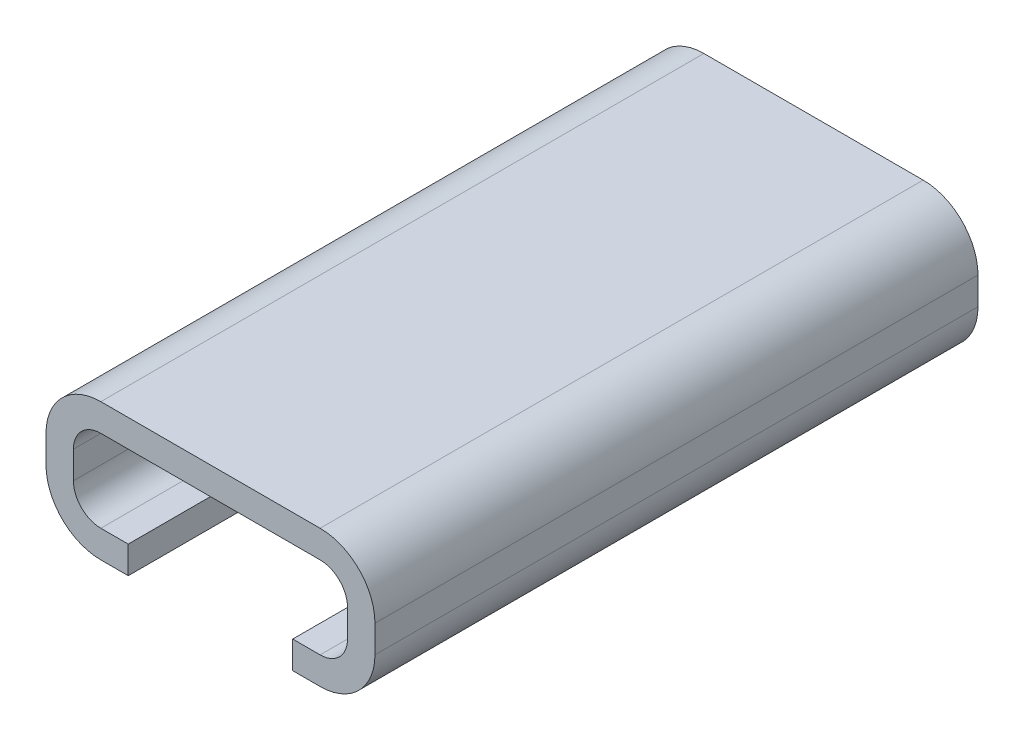
ISO-10303-21;
HEADER;
FILE_DESCRIPTION(('STEP AP214'),'2;1');
FILE_NAME('part.step','',(''),(''),'','','');
FILE_SCHEMA(('AUTOMOTIVE_DESIGN { 1 0 10303 214 1 1 1 1 }'));
ENDSEC;
DATA;
#1=APPLICATION_CONTEXT('core data for automotive mechanical design processes');
#2=APPLICATION_PROTOCOL_DEFINITION('international standard','automotive_design',2000,#1);
#3=PRODUCT_CONTEXT('',#1,'mechanical');
#4=PRODUCT('Part','Part','',(#3));
#5=PRODUCT_RELATED_PRODUCT_CATEGORY('part','',(#4));
#6=PRODUCT_DEFINITION_FORMATION('','',#4);
#7=PRODUCT_DEFINITION_CONTEXT('part definition',#1,'design');
#8=PRODUCT_DEFINITION('design','',#6,#7);
#9=PRODUCT_DEFINITION_SHAPE('','',#8);
#10=(LENGTH_UNIT() NAMED_UNIT(*) SI_UNIT(.MILLI.,.METRE.));
#11=(NAMED_UNIT(*) PLANE_ANGLE_UNIT() SI_UNIT($,.RADIAN.));
#12=(NAMED_UNIT(*) SI_UNIT($,.STERADIAN.) SOLID_ANGLE_UNIT());
#13=UNCERTAINTY_MEASURE_WITH_UNIT(LENGTH_MEASURE(1.E-05),#10,'distance_accuracy_value','');
#14=(GEOMETRIC_REPRESENTATION_CONTEXT(3) GLOBAL_UNCERTAINTY_ASSIGNED_CONTEXT((#13)) GLOBAL_UNIT_ASSIGNED_CONTEXT((#10,
#11,#12)) REPRESENTATION_CONTEXT('',''));
#15=CARTESIAN_POINT('',(0.,0.,0.));
#16=DIRECTION('',(0.,0.,1.));
#17=DIRECTION('',(1.,0.,0.));
#18=AXIS2_PLACEMENT_3D('',#15,#16,#17);
#19=CARTESIAN_POINT('',(4.,-1.5,10.));
#20=DIRECTION('',(0.,-1.,0.));
#21=DIRECTION('',(1.,0.,0.));
#22=AXIS2_PLACEMENT_3D('',#19,#20,#21);
#23=PLANE('',#22);
#24=DIRECTION('',(-1.,0.,0.));
#25=VECTOR('',#24,1.);
#26=CARTESIAN_POINT('',(4.,-1.5,10.));
#27=LINE('',#26,#25);
#28=CARTESIAN_POINT('',(-3.,-1.5,10.));
#29=VERTEX_POINT('',#28);
#30=CARTESIAN_POINT('',(-4.,-1.5,10.));
#31=VERTEX_POINT('',#30);
#32=EDGE_CURVE('E445',#29,#31,#27,.T.);
#33=ORIENTED_EDGE('',*,*,#32,.F.);
#34=DIRECTION('',(0.,0.,1.));
#35=VECTOR('',#34,1.);
#36=CARTESIAN_POINT('',(-3.,-1.5,10.));
#37=LINE('',#36,#35);
#38=CARTESIAN_POINT('',(-3.,-1.5,0.));
#39=VERTEX_POINT('',#38);
#40=EDGE_CURVE('E312',#39,#29,#37,.T.);
#41=ORIENTED_EDGE('',*,*,#40,.F.);
#42=DIRECTION('',(-1.,0.,0.));
#43=VECTOR('',#42,1.);
#44=CARTESIAN_POINT('',(4.,-1.5,0.));
#45=LINE('',#44,#43);
#46=CARTESIAN_POINT('',(-4.,-1.5,0.));
#47=VERTEX_POINT('',#46);
#48=EDGE_CURVE('E469',#39,#47,#45,.T.);
#49=ORIENTED_EDGE('',*,*,#48,.T.);
#50=DIRECTION('',(0.,0.,-1.));
#51=VECTOR('',#50,1.);
#52=CARTESIAN_POINT('',(-4.,-1.5,10.));
#53=LINE('',#52,#51);
#54=EDGE_CURVE('E498',#31,#47,#53,.T.);
#55=ORIENTED_EDGE('',*,*,#54,.F.);
#56=EDGE_LOOP('',(#33,#41,#49,#55));
#57=FACE_BOUND('',#56,.T.);
#58=ADVANCED_FACE('F84',(#57),#23,.F.);
#59=CARTESIAN_POINT('',(4.,-1.5,-12.));
#60=DIRECTION('',(0.,-1.,0.));
#61=DIRECTION('',(1.,0.,0.));
#62=AXIS2_PLACEMENT_3D('',#59,#60,#61);
#63=PLANE('',#62);
#64=DIRECTION('',(-1.,0.,0.));
#65=VECTOR('',#64,1.);
#66=CARTESIAN_POINT('',(4.,-1.5,-12.));
#67=LINE('',#66,#65);
#68=CARTESIAN_POINT('',(4.,-1.5,-12.));
#69=VERTEX_POINT('',#68);
#70=CARTESIAN_POINT('',(3.,-1.5,-12.));
#71=VERTEX_POINT('',#70);
#72=EDGE_CURVE('E355',#69,#71,#67,.T.);
#73=ORIENTED_EDGE('',*,*,#72,.T.);
#74=DIRECTION('',(0.,0.,-1.));
#75=VECTOR('',#74,1.);
#76=CARTESIAN_POINT('',(3.,-1.5,-12.));
#77=LINE('',#76,#75);
#78=CARTESIAN_POINT('',(3.,-1.5,-2.));
#79=VERTEX_POINT('',#78);
#80=EDGE_CURVE('E375',#79,#71,#77,.T.);
#81=ORIENTED_EDGE('',*,*,#80,.F.);
#82=DIRECTION('',(-1.,0.,0.));
#83=VECTOR('',#82,1.);
#84=CARTESIAN_POINT('',(4.,-1.5,-2.));
#85=LINE('',#84,#83);
#86=CARTESIAN_POINT('',(4.,-1.5,-2.));
#87=VERTEX_POINT('',#86);
#88=EDGE_CURVE('E299',#87,#79,#85,.T.);
#89=ORIENTED_EDGE('',*,*,#88,.F.);
#90=DIRECTION('',(0.,0.,1.));
#91=VECTOR('',#90,1.);
#92=CARTESIAN_POINT('',(4.,-1.5,-12.));
#93=LINE('',#92,#91);
#94=EDGE_CURVE('E399',#69,#87,#93,.T.);
#95=ORIENTED_EDGE('',*,*,#94,.F.);
#96=EDGE_LOOP('',(#73,#81,#89,#95));
#97=FACE_BOUND('',#96,.T.);
#98=ADVANCED_FACE('F625',(#97),#63,.F.);
#99=CARTESIAN_POINT('',(4.,0.500000000000002,10.));
#100=DIRECTION('',(0.,0.,-1.));
#101=DIRECTION('',(-1.,0.,0.));
#102=AXIS2_PLACEMENT_3D('',#99,#100,#101);
#103=PLANE('',#102);
#104=DIRECTION('',(-1.,0.,0.));
#105=VECTOR('',#104,1.);
#106=CARTESIAN_POINT('',(4.,-2.5,10.));
#107=LINE('',#106,#105);
#108=CARTESIAN_POINT('',(-3.,-2.5,10.));
#109=VERTEX_POINT('',#108);
#110=CARTESIAN_POINT('',(-4.,-2.5,10.));
#111=VERTEX_POINT('',#110);
#112=EDGE_CURVE('E516',#109,#111,#107,.T.);
#113=ORIENTED_EDGE('',*,*,#112,.F.);
#114=DIRECTION('',(0.,-1.,0.));
#115=VECTOR('',#114,1.);
#116=CARTESIAN_POINT('',(-3.,10.1619037896906,10.));
#117=LINE('',#116,#115);
#118=EDGE_CURVE('E328',#29,#109,#117,.T.);
#119=ORIENTED_EDGE('',*,*,#118,.F.);
#120=ORIENTED_EDGE('',*,*,#32,.T.);
#121=CARTESIAN_POINT('',(-4.,-0.5,10.));
#122=DIRECTION('',(0.,0.,-1.));
#123=DIRECTION('',(-1.,0.,0.));
#124=AXIS2_PLACEMENT_3D('',#121,#122,#123);
#125=CIRCLE('',#124,1.);
#126=CARTESIAN_POINT('',(-5.,-0.5,10.));
#127=VERTEX_POINT('',#126);
#128=EDGE_CURVE('E442',#31,#127,#125,.T.);
#129=ORIENTED_EDGE('',*,*,#128,.T.);
#130=DIRECTION('',(0.,1.,0.));
#131=VECTOR('',#130,1.);
#132=CARTESIAN_POINT('',(-5.,-0.5,10.));
#133=LINE('',#132,#131);
#134=CARTESIAN_POINT('',(-5.,0.5,10.));
#135=VERTEX_POINT('',#134);
#136=EDGE_CURVE('E438',#127,#135,#133,.T.);
#137=ORIENTED_EDGE('',*,*,#136,.T.);
#138=CARTESIAN_POINT('',(-4.,0.5,10.));
#139=DIRECTION('',(0.,0.,1.));
#140=DIRECTION('',(1.,0.,0.));
#141=AXIS2_PLACEMENT_3D('',#138,#139,#140);
#142=CIRCLE('',#141,1.);
#143=CARTESIAN_POINT('',(-4.,1.5,10.));
#144=VERTEX_POINT('',#143);
#145=EDGE_CURVE('E436',#144,#135,#142,.T.);
#146=ORIENTED_EDGE('',*,*,#145,.F.);
#147=DIRECTION('',(1.,0.,0.));
#148=VECTOR('',#147,1.);
#149=CARTESIAN_POINT('',(-4.,1.5,10.));
#150=LINE('',#149,#148);
#151=CARTESIAN_POINT('',(4.,1.5,10.));
#152=VERTEX_POINT('',#151);
#153=EDGE_CURVE('E458',#144,#152,#150,.T.);
#154=ORIENTED_EDGE('',*,*,#153,.T.);
#155=CARTESIAN_POINT('',(4.,0.500000000000002,10.));
#156=DIRECTION('',(0.,0.,-1.));
#157=DIRECTION('',(-1.,0.,0.));
#158=AXIS2_PLACEMENT_3D('',#155,#156,#157);
#159=CIRCLE('',#158,0.999999999999998);
#160=CARTESIAN_POINT('',(5.,0.500000000000002,10.));
#161=VERTEX_POINT('',#160);
#162=EDGE_CURVE('E455',#152,#161,#159,.T.);
#163=ORIENTED_EDGE('',*,*,#162,.T.);
#164=DIRECTION('',(0.,-1.,0.));
#165=VECTOR('',#164,1.);
#166=CARTESIAN_POINT('',(5.,0.500000000000002,10.));
#167=LINE('',#166,#165);
#168=CARTESIAN_POINT('',(5.,-0.5,10.));
#169=VERTEX_POINT('',#168);
#170=EDGE_CURVE('E452',#161,#169,#167,.T.);
#171=ORIENTED_EDGE('',*,*,#170,.T.);
#172=CARTESIAN_POINT('',(4.,-0.5,10.));
#173=DIRECTION('',(0.,0.,-1.));
#174=DIRECTION('',(-1.,0.,0.));
#175=AXIS2_PLACEMENT_3D('',#172,#173,#174);
#176=CIRCLE('',#175,1.);
#177=CARTESIAN_POINT('',(4.,-1.5,10.));
#178=VERTEX_POINT('',#177);
#179=EDGE_CURVE('E449',#169,#178,#176,.T.);
#180=ORIENTED_EDGE('',*,*,#179,.T.);
#181=CARTESIAN_POINT('',(3.,-1.5,10.));
#182=VERTEX_POINT('',#181);
#183=EDGE_CURVE('E446',#178,#182,#27,.T.);
#184=ORIENTED_EDGE('',*,*,#183,.T.);
#185=DIRECTION('',(0.,-1.,0.));
#186=VECTOR('',#185,1.);
#187=CARTESIAN_POINT('',(3.,10.1619037896906,10.));
#188=LINE('',#187,#186);
#189=CARTESIAN_POINT('',(3.,-2.5,10.));
#190=VERTEX_POINT('',#189);
#191=EDGE_CURVE('E339',#182,#190,#188,.T.);
#192=ORIENTED_EDGE('',*,*,#191,.T.);
#193=CARTESIAN_POINT('',(4.,-2.5,10.));
#194=VERTEX_POINT('',#193);
#195=EDGE_CURVE('E517',#194,#190,#107,.T.);
#196=ORIENTED_EDGE('',*,*,#195,.F.);
#197=CARTESIAN_POINT('',(4.,-0.5,10.));
#198=DIRECTION('',(0.,0.,-1.));
#199=DIRECTION('',(-1.,0.,0.));
#200=AXIS2_PLACEMENT_3D('',#197,#198,#199);
#201=CIRCLE('',#200,2.);
#202=CARTESIAN_POINT('',(6.,-0.5,10.));
#203=VERTEX_POINT('',#202);
#204=EDGE_CURVE('E513',#203,#194,#201,.T.);
#205=ORIENTED_EDGE('',*,*,#204,.F.);
#206=DIRECTION('',(0.,-1.,0.));
#207=VECTOR('',#206,1.);
#208=CARTESIAN_POINT('',(6.,0.500000000000002,10.));
#209=LINE('',#208,#207);
#210=CARTESIAN_POINT('',(6.,0.500000000000002,10.));
#211=VERTEX_POINT('',#210);
#212=EDGE_CURVE('E510',#211,#203,#209,.T.);
#213=ORIENTED_EDGE('',*,*,#212,.F.);
#214=CARTESIAN_POINT('',(4.,0.500000000000002,10.));
#215=DIRECTION('',(0.,0.,-1.));
#216=DIRECTION('',(-1.,0.,0.));
#217=AXIS2_PLACEMENT_3D('',#214,#215,#216);
#218=CIRCLE('',#217,2.);
#219=CARTESIAN_POINT('',(4.,2.5,10.));
#220=VERTEX_POINT('',#219);
#221=EDGE_CURVE('E507',#220,#211,#218,.T.);
#222=ORIENTED_EDGE('',*,*,#221,.F.);
#223=DIRECTION('',(1.,0.,0.));
#224=VECTOR('',#223,1.);
#225=CARTESIAN_POINT('',(-4.,2.5,10.));
#226=LINE('',#225,#224);
#227=CARTESIAN_POINT('',(-4.,2.5,10.));
#228=VERTEX_POINT('',#227);
#229=EDGE_CURVE('E528',#228,#220,#226,.T.);
#230=ORIENTED_EDGE('',*,*,#229,.F.);
#231=CARTESIAN_POINT('',(-4.,0.5,10.));
#232=DIRECTION('',(0.,0.,1.));
#233=DIRECTION('',(1.,0.,0.));
#234=AXIS2_PLACEMENT_3D('',#231,#232,#233);
#235=CIRCLE('',#234,2.);
#236=CARTESIAN_POINT('',(-6.,0.500000000000001,10.));
#237=VERTEX_POINT('',#236);
#238=EDGE_CURVE('E526',#228,#237,#235,.T.);
#239=ORIENTED_EDGE('',*,*,#238,.T.);
#240=DIRECTION('',(0.,1.,0.));
#241=VECTOR('',#240,1.);
#242=CARTESIAN_POINT('',(-6.,-0.5,10.));
#243=LINE('',#242,#241);
#244=CARTESIAN_POINT('',(-6.,-0.5,10.));
#245=VERTEX_POINT('',#244);
#246=EDGE_CURVE('E523',#245,#237,#243,.T.);
#247=ORIENTED_EDGE('',*,*,#246,.F.);
#248=CARTESIAN_POINT('',(-4.,-0.5,10.));
#249=DIRECTION('',(0.,0.,-1.));
#250=DIRECTION('',(-1.,0.,0.));
#251=AXIS2_PLACEMENT_3D('',#248,#249,#250);
#252=CIRCLE('',#251,2.);
#253=EDGE_CURVE('E520',#111,#245,#252,.T.);
#254=ORIENTED_EDGE('',*,*,#253,.F.);
#255=EDGE_LOOP('',(#113,#119,#120,#129,#137,#146,#154,#163,#171,#180,#184,#192,#196,#205,#213,
#222,#230,#239,#247,#254));
#256=FACE_BOUND('',#255,.T.);
#257=ADVANCED_FACE('F559',(#256),#103,.F.);
#258=CARTESIAN_POINT('',(4.,0.500000000000002,10.));
#259=DIRECTION('',(0.,0.,-1.));
#260=DIRECTION('',(-1.,0.,0.));
#261=AXIS2_PLACEMENT_3D('',#258,#259,#260);
#262=CYLINDRICAL_SURFACE('',#261,2.);
#263=DIRECTION('',(0.,0.,-1.));
#264=VECTOR('',#263,1.);
#265=CARTESIAN_POINT('',(6.,0.500000000000002,10.));
#266=LINE('',#265,#264);
#267=CARTESIAN_POINT('',(6.,0.500000000000002,-12.));
#268=VERTEX_POINT('',#267);
#269=EDGE_CURVE('E88',#211,#268,#266,.T.);
#270=ORIENTED_EDGE('',*,*,#269,.T.);
#271=CARTESIAN_POINT('',(4.,0.500000000000002,-12.));
#272=DIRECTION('',(0.,0.,-1.));
#273=DIRECTION('',(-1.,0.,0.));
#274=AXIS2_PLACEMENT_3D('',#271,#272,#273);
#275=CIRCLE('',#274,2.);
#276=CARTESIAN_POINT('',(4.,2.5,-12.));
#277=VERTEX_POINT('',#276);
#278=EDGE_CURVE('E411',#277,#268,#275,.T.);
#279=ORIENTED_EDGE('',*,*,#278,.F.);
#280=DIRECTION('',(0.,0.,-1.));
#281=VECTOR('',#280,1.);
#282=CARTESIAN_POINT('',(4.,2.5,10.));
#283=LINE('',#282,#281);
#284=EDGE_CURVE('E12',#220,#277,#283,.T.);
#285=ORIENTED_EDGE('',*,*,#284,.F.);
#286=ORIENTED_EDGE('',*,*,#221,.T.);
#287=EDGE_LOOP('',(#270,#279,#285,#286));
#288=FACE_BOUND('',#287,.T.);
#289=ADVANCED_FACE('F86',(#288),#262,.T.);
#290=CARTESIAN_POINT('',(4.,2.5,10.));
#291=DIRECTION('',(0.,-1.,0.));
#292=DIRECTION('',(1.,0.,0.));
#293=AXIS2_PLACEMENT_3D('',#290,#291,#292);
#294=PLANE('',#293);
#295=ORIENTED_EDGE('',*,*,#284,.T.);
#296=DIRECTION('',(1.,0.,0.));
#297=VECTOR('',#296,1.);
#298=CARTESIAN_POINT('',(-4.,2.5,-12.));
#299=LINE('',#298,#297);
#300=CARTESIAN_POINT('',(-4.,2.5,-12.));
#301=VERTEX_POINT('',#300);
#302=EDGE_CURVE('E432',#301,#277,#299,.T.);
#303=ORIENTED_EDGE('',*,*,#302,.F.);
#304=DIRECTION('',(0.,0.,-1.));
#305=VECTOR('',#304,1.);
#306=CARTESIAN_POINT('',(-4.,2.5,10.));
#307=LINE('',#306,#305);
#308=EDGE_CURVE('E93',#228,#301,#307,.T.);
#309=ORIENTED_EDGE('',*,*,#308,.F.);
#310=ORIENTED_EDGE('',*,*,#229,.T.);
#311=EDGE_LOOP('',(#295,#303,#309,#310));
#312=FACE_BOUND('',#311,.T.);
#313=ADVANCED_FACE('F554',(#312),#294,.F.);
#314=CARTESIAN_POINT('',(-4.,0.5,10.));
#315=DIRECTION('',(0.,0.,-1.));
#316=DIRECTION('',(-1.,0.,0.));
#317=AXIS2_PLACEMENT_3D('',#314,#315,#316);
#318=CYLINDRICAL_SURFACE('',#317,2.);
#319=ORIENTED_EDGE('',*,*,#308,.T.);
#320=CARTESIAN_POINT('',(-4.,0.5,-12.));
#321=DIRECTION('',(0.,0.,1.));
#322=DIRECTION('',(1.,0.,0.));
#323=AXIS2_PLACEMENT_3D('',#320,#321,#322);
#324=CIRCLE('',#323,2.);
#325=CARTESIAN_POINT('',(-6.,0.500000000000001,-12.));
#326=VERTEX_POINT('',#325);
#327=EDGE_CURVE('E429',#301,#326,#324,.T.);
#328=ORIENTED_EDGE('',*,*,#327,.T.);
#329=DIRECTION('',(0.,0.,-1.));
#330=VECTOR('',#329,1.);
#331=CARTESIAN_POINT('',(-6.,0.500000000000001,10.));
#332=LINE('',#331,#330);
#333=EDGE_CURVE('E531',#237,#326,#332,.T.);
#334=ORIENTED_EDGE('',*,*,#333,.F.);
#335=ORIENTED_EDGE('',*,*,#238,.F.);
#336=EDGE_LOOP('',(#319,#328,#334,#335));
#337=FACE_BOUND('',#336,.T.);
#338=ADVANCED_FACE('F684',(#337),#318,.T.);
#339=CARTESIAN_POINT('',(-6.,-0.5,10.));
#340=DIRECTION('',(-1.,0.,0.));
#341=DIRECTION('',(0.,0.,1.));
#342=AXIS2_PLACEMENT_3D('',#339,#340,#341);
#343=PLANE('',#342);
#344=ORIENTED_EDGE('',*,*,#333,.T.);
#345=DIRECTION('',(0.,1.,0.));
#346=VECTOR('',#345,1.);
#347=CARTESIAN_POINT('',(-6.,-0.5,-12.));
#348=LINE('',#347,#346);
#349=CARTESIAN_POINT('',(-6.,-0.5,-12.));
#350=VERTEX_POINT('',#349);
#351=EDGE_CURVE('E426',#350,#326,#348,.T.);
#352=ORIENTED_EDGE('',*,*,#351,.F.);
#353=DIRECTION('',(0.,0.,-1.));
#354=VECTOR('',#353,1.);
#355=CARTESIAN_POINT('',(-6.,-0.5,10.));
#356=LINE('',#355,#354);
#357=EDGE_CURVE('E533',#245,#350,#356,.T.);
#358=ORIENTED_EDGE('',*,*,#357,.F.);
#359=ORIENTED_EDGE('',*,*,#246,.T.);
#360=EDGE_LOOP('',(#344,#352,#358,#359));
#361=FACE_BOUND('',#360,.T.);
#362=ADVANCED_FACE('F687',(#361),#343,.T.);
#363=CARTESIAN_POINT('',(-4.,-0.5,10.));
#364=DIRECTION('',(0.,0.,-1.));
#365=DIRECTION('',(-1.,0.,0.));
#366=AXIS2_PLACEMENT_3D('',#363,#364,#365);
#367=CYLINDRICAL_SURFACE('',#366,2.);
#368=ORIENTED_EDGE('',*,*,#357,.T.);
#369=CARTESIAN_POINT('',(-4.,-0.5,-12.));
#370=DIRECTION('',(0.,0.,-1.));
#371=DIRECTION('',(-1.,0.,0.));
#372=AXIS2_PLACEMENT_3D('',#369,#370,#371);
#373=CIRCLE('',#372,2.);
#374=CARTESIAN_POINT('',(-4.,-2.5,-12.));
#375=VERTEX_POINT('',#374);
#376=EDGE_CURVE('E423',#375,#350,#373,.T.);
#377=ORIENTED_EDGE('',*,*,#376,.F.);
#378=DIRECTION('',(0.,0.,-1.));
#379=VECTOR('',#378,1.);
#380=CARTESIAN_POINT('',(-4.,-2.5,10.));
#381=LINE('',#380,#379);
#382=EDGE_CURVE('E535',#111,#375,#381,.T.);
#383=ORIENTED_EDGE('',*,*,#382,.F.);
#384=ORIENTED_EDGE('',*,*,#253,.T.);
#385=EDGE_LOOP('',(#368,#377,#383,#384));
#386=FACE_BOUND('',#385,.T.);
#387=ADVANCED_FACE('F612',(#386),#367,.T.);
#388=CARTESIAN_POINT('',(4.,-2.5,10.));
#389=DIRECTION('',(0.,-1.,0.));
#390=DIRECTION('',(1.,0.,0.));
#391=AXIS2_PLACEMENT_3D('',#388,#389,#390);
#392=PLANE('',#391);
#393=DIRECTION('',(0.,0.,1.));
#394=VECTOR('',#393,1.);
#395=CARTESIAN_POINT('',(3.,-2.5,-12.));
#396=LINE('',#395,#394);
#397=CARTESIAN_POINT('',(3.,-2.5,-12.));
#398=VERTEX_POINT('',#397);
#399=CARTESIAN_POINT('',(3.,-2.5,-2.));
#400=VERTEX_POINT('',#399);
#401=EDGE_CURVE('E305',#398,#400,#396,.T.);
#402=ORIENTED_EDGE('',*,*,#401,.F.);
#403=DIRECTION('',(-1.,0.,0.));
#404=VECTOR('',#403,1.);
#405=CARTESIAN_POINT('',(4.,-2.5,-12.));
#406=LINE('',#405,#404);
#407=CARTESIAN_POINT('',(4.,-2.5,-12.));
#408=VERTEX_POINT('',#407);
#409=EDGE_CURVE('E421',#408,#398,#406,.T.);
#410=ORIENTED_EDGE('',*,*,#409,.F.);
#411=DIRECTION('',(0.,0.,-1.));
#412=VECTOR('',#411,1.);
#413=CARTESIAN_POINT('',(4.,-2.5,10.));
#414=LINE('',#413,#412);
#415=EDGE_CURVE('E538',#194,#408,#414,.T.);
#416=ORIENTED_EDGE('',*,*,#415,.F.);
#417=ORIENTED_EDGE('',*,*,#195,.T.);
#418=DIRECTION('',(0.,0.,1.));
#419=VECTOR('',#418,1.);
#420=CARTESIAN_POINT('',(3.,-2.5,10.));
#421=LINE('',#420,#419);
#422=CARTESIAN_POINT('',(3.,-2.5,0.));
#423=VERTEX_POINT('',#422);
#424=EDGE_CURVE('E335',#423,#190,#421,.T.);
#425=ORIENTED_EDGE('',*,*,#424,.F.);
#426=DIRECTION('',(1.,0.,0.));
#427=VECTOR('',#426,1.);
#428=CARTESIAN_POINT('',(-3.,-2.5,0.));
#429=LINE('',#428,#427);
#430=CARTESIAN_POINT('',(-3.,-2.5,0.));
#431=VERTEX_POINT('',#430);
#432=EDGE_CURVE('E333',#431,#423,#429,.T.);
#433=ORIENTED_EDGE('',*,*,#432,.F.);
#434=DIRECTION('',(0.,0.,-1.));
#435=VECTOR('',#434,1.);
#436=CARTESIAN_POINT('',(-3.,-2.5,10.));
#437=LINE('',#436,#435);
#438=EDGE_CURVE('E330',#109,#431,#437,.T.);
#439=ORIENTED_EDGE('',*,*,#438,.F.);
#440=ORIENTED_EDGE('',*,*,#112,.T.);
#441=ORIENTED_EDGE('',*,*,#382,.T.);
#442=CARTESIAN_POINT('',(-3.,-2.5,-12.));
#443=VERTEX_POINT('',#442);
#444=EDGE_CURVE('E420',#443,#375,#406,.T.);
#445=ORIENTED_EDGE('',*,*,#444,.F.);
#446=DIRECTION('',(0.,0.,-1.));
#447=VECTOR('',#446,1.);
#448=CARTESIAN_POINT('',(-3.,-2.5,-12.));
#449=LINE('',#448,#447);
#450=CARTESIAN_POINT('',(-3.,-2.5,-2.));
#451=VERTEX_POINT('',#450);
#452=EDGE_CURVE('E302',#451,#443,#449,.T.);
#453=ORIENTED_EDGE('',*,*,#452,.F.);
#454=DIRECTION('',(-1.,0.,0.));
#455=VECTOR('',#454,1.);
#456=CARTESIAN_POINT('',(3.,-2.5,-2.));
#457=LINE('',#456,#455);
#458=EDGE_CURVE('E296',#400,#451,#457,.T.);
#459=ORIENTED_EDGE('',*,*,#458,.F.);
#460=EDGE_LOOP('',(#402,#410,#416,#417,#425,#433,#439,#440,#441,#445,#453,#459));
#461=FACE_BOUND('',#460,.T.);
#462=ADVANCED_FACE('F314',(#461),#392,.T.);
#463=CARTESIAN_POINT('',(4.,-0.5,10.));
#464=DIRECTION('',(0.,0.,-1.));
#465=DIRECTION('',(-1.,0.,0.));
#466=AXIS2_PLACEMENT_3D('',#463,#464,#465);
#467=CYLINDRICAL_SURFACE('',#466,2.);
#468=ORIENTED_EDGE('',*,*,#415,.T.);
#469=CARTESIAN_POINT('',(4.,-0.5,-12.));
#470=DIRECTION('',(0.,0.,-1.));
#471=DIRECTION('',(-1.,0.,0.));
#472=AXIS2_PLACEMENT_3D('',#469,#470,#471);
#473=CIRCLE('',#472,2.);
#474=CARTESIAN_POINT('',(6.,-0.5,-12.));
#475=VERTEX_POINT('',#474);
#476=EDGE_CURVE('E417',#475,#408,#473,.T.);
#477=ORIENTED_EDGE('',*,*,#476,.F.);
#478=DIRECTION('',(0.,0.,-1.));
#479=VECTOR('',#478,1.);
#480=CARTESIAN_POINT('',(6.,-0.5,10.));
#481=LINE('',#480,#479);
#482=EDGE_CURVE('E539',#203,#475,#481,.T.);
#483=ORIENTED_EDGE('',*,*,#482,.F.);
#484=ORIENTED_EDGE('',*,*,#204,.T.);
#485=EDGE_LOOP('',(#468,#477,#483,#484));
#486=FACE_BOUND('',#485,.T.);
#487=ADVANCED_FACE('F563',(#486),#467,.T.);
#488=CARTESIAN_POINT('',(6.,0.500000000000002,10.));
#489=DIRECTION('',(1.,0.,0.));
#490=DIRECTION('',(0.,0.,-1.));
#491=AXIS2_PLACEMENT_3D('',#488,#489,#490);
#492=PLANE('',#491);
#493=ORIENTED_EDGE('',*,*,#482,.T.);
#494=DIRECTION('',(0.,-1.,0.));
#495=VECTOR('',#494,1.);
#496=CARTESIAN_POINT('',(6.,0.500000000000002,-12.));
#497=LINE('',#496,#495);
#498=EDGE_CURVE('E414',#268,#475,#497,.T.);
#499=ORIENTED_EDGE('',*,*,#498,.F.);
#500=ORIENTED_EDGE('',*,*,#269,.F.);
#501=ORIENTED_EDGE('',*,*,#212,.T.);
#502=EDGE_LOOP('',(#493,#499,#500,#501));
#503=FACE_BOUND('',#502,.T.);
#504=ADVANCED_FACE('F548',(#503),#492,.T.);
#505=CARTESIAN_POINT('',(-4.,0.5,10.));
#506=DIRECTION('',(0.,0.,-1.));
#507=DIRECTION('',(-1.,0.,0.));
#508=AXIS2_PLACEMENT_3D('',#505,#506,#507);
#509=CYLINDRICAL_SURFACE('',#508,1.);
#510=CARTESIAN_POINT('',(-4.,0.5,0.));
#511=DIRECTION('',(0.,0.,1.));
#512=DIRECTION('',(1.,0.,0.));
#513=AXIS2_PLACEMENT_3D('',#510,#511,#512);
#514=CIRCLE('',#513,1.);
#515=CARTESIAN_POINT('',(-4.,1.5,0.));
#516=VERTEX_POINT('',#515);
#517=CARTESIAN_POINT('',(-5.,0.5,0.));
#518=VERTEX_POINT('',#517);
#519=EDGE_CURVE('E435',#516,#518,#514,.T.);
#520=ORIENTED_EDGE('',*,*,#519,.F.);
#521=DIRECTION('',(0.,0.,-1.));
#522=VECTOR('',#521,1.);
#523=CARTESIAN_POINT('',(-4.,1.5,10.));
#524=LINE('',#523,#522);
#525=EDGE_CURVE('E461',#144,#516,#524,.T.);
#526=ORIENTED_EDGE('',*,*,#525,.F.);
#527=ORIENTED_EDGE('',*,*,#145,.T.);
#528=DIRECTION('',(0.,0.,-1.));
#529=VECTOR('',#528,1.);
#530=CARTESIAN_POINT('',(-5.,0.5,10.));
#531=LINE('',#530,#529);
#532=EDGE_CURVE('E504',#135,#518,#531,.T.);
#533=ORIENTED_EDGE('',*,*,#532,.T.);
#534=EDGE_LOOP('',(#520,#526,#527,#533));
#535=FACE_BOUND('',#534,.T.);
#536=ADVANCED_FACE('F587',(#535),#509,.F.);
#537=CARTESIAN_POINT('',(-5.,-0.5,10.));
#538=DIRECTION('',(-1.,0.,0.));
#539=DIRECTION('',(0.,0.,1.));
#540=AXIS2_PLACEMENT_3D('',#537,#538,#539);
#541=PLANE('',#540);
#542=DIRECTION('',(0.,1.,0.));
#543=VECTOR('',#542,1.);
#544=CARTESIAN_POINT('',(-5.,-0.5,0.));
#545=LINE('',#544,#543);
#546=CARTESIAN_POINT('',(-5.,-0.5,0.));
#547=VERTEX_POINT('',#546);
#548=EDGE_CURVE('E463',#547,#518,#545,.T.);
#549=ORIENTED_EDGE('',*,*,#548,.T.);
#550=ORIENTED_EDGE('',*,*,#532,.F.);
#551=ORIENTED_EDGE('',*,*,#136,.F.);
#552=DIRECTION('',(0.,0.,-1.));
#553=VECTOR('',#552,1.);
#554=CARTESIAN_POINT('',(-5.,-0.5,10.));
#555=LINE('',#554,#553);
#556=EDGE_CURVE('E501',#127,#547,#555,.T.);
#557=ORIENTED_EDGE('',*,*,#556,.T.);
#558=EDGE_LOOP('',(#549,#550,#551,#557));
#559=FACE_BOUND('',#558,.T.);
#560=ADVANCED_FACE('F594',(#559),#541,.F.);
#561=CARTESIAN_POINT('',(-4.,-0.5,10.));
#562=DIRECTION('',(0.,0.,-1.));
#563=DIRECTION('',(-1.,0.,0.));
#564=AXIS2_PLACEMENT_3D('',#561,#562,#563);
#565=CYLINDRICAL_SURFACE('',#564,1.);
#566=CARTESIAN_POINT('',(-4.,-0.5,0.));
#567=DIRECTION('',(0.,0.,-1.));
#568=DIRECTION('',(-1.,0.,0.));
#569=AXIS2_PLACEMENT_3D('',#566,#567,#568);
#570=CIRCLE('',#569,1.);
#571=EDGE_CURVE('E466',#47,#547,#570,.T.);
#572=ORIENTED_EDGE('',*,*,#571,.T.);
#573=ORIENTED_EDGE('',*,*,#556,.F.);
#574=ORIENTED_EDGE('',*,*,#128,.F.);
#575=ORIENTED_EDGE('',*,*,#54,.T.);
#576=EDGE_LOOP('',(#572,#573,#574,#575));
#577=FACE_BOUND('',#576,.T.);
#578=ADVANCED_FACE('F600',(#577),#565,.F.);
#579=CARTESIAN_POINT('',(4.,-1.5,0.));
#580=VERTEX_POINT('',#579);
#581=CARTESIAN_POINT('',(3.,-1.5,0.));
#582=VERTEX_POINT('',#581);
#583=EDGE_CURVE('E470',#580,#582,#45,.T.);
#584=ORIENTED_EDGE('',*,*,#583,.T.);
#585=DIRECTION('',(0.,0.,-1.));
#586=VECTOR('',#585,1.);
#587=CARTESIAN_POINT('',(3.,-1.5,10.));
#588=LINE('',#587,#586);
#589=EDGE_CURVE('E326',#182,#582,#588,.T.);
#590=ORIENTED_EDGE('',*,*,#589,.F.);
#591=ORIENTED_EDGE('',*,*,#183,.F.);
#592=DIRECTION('',(0.,0.,-1.));
#593=VECTOR('',#592,1.);
#594=CARTESIAN_POINT('',(4.,-1.5,10.));
#595=LINE('',#594,#593);
#596=EDGE_CURVE('E495',#178,#580,#595,.T.);
#597=ORIENTED_EDGE('',*,*,#596,.T.);
#598=EDGE_LOOP('',(#584,#590,#591,#597));
#599=FACE_BOUND('',#598,.T.);
#600=ADVANCED_FACE('F574',(#599),#23,.F.);
#601=CARTESIAN_POINT('',(4.,-0.5,10.));
#602=DIRECTION('',(0.,0.,-1.));
#603=DIRECTION('',(-1.,0.,0.));
#604=AXIS2_PLACEMENT_3D('',#601,#602,#603);
#605=CYLINDRICAL_SURFACE('',#604,1.);
#606=CARTESIAN_POINT('',(4.,-0.5,0.));
#607=DIRECTION('',(0.,0.,-1.));
#608=DIRECTION('',(-1.,0.,0.));
#609=AXIS2_PLACEMENT_3D('',#606,#607,#608);
#610=CIRCLE('',#609,1.);
#611=CARTESIAN_POINT('',(5.,-0.5,0.));
#612=VERTEX_POINT('',#611);
#613=EDGE_CURVE('E473',#612,#580,#610,.T.);
#614=ORIENTED_EDGE('',*,*,#613,.T.);
#615=ORIENTED_EDGE('',*,*,#596,.F.);
#616=ORIENTED_EDGE('',*,*,#179,.F.);
#617=DIRECTION('',(0.,0.,-1.));
#618=VECTOR('',#617,1.);
#619=CARTESIAN_POINT('',(5.,-0.5,10.));
#620=LINE('',#619,#618);
#621=EDGE_CURVE('E492',#169,#612,#620,.T.);
#622=ORIENTED_EDGE('',*,*,#621,.T.);
#623=EDGE_LOOP('',(#614,#615,#616,#622));
#624=FACE_BOUND('',#623,.T.);
#625=ADVANCED_FACE('F577',(#624),#605,.F.);
#626=CARTESIAN_POINT('',(5.,0.500000000000002,10.));
#627=DIRECTION('',(1.,0.,0.));
#628=DIRECTION('',(0.,0.,-1.));
#629=AXIS2_PLACEMENT_3D('',#626,#627,#628);
#630=PLANE('',#629);
#631=DIRECTION('',(0.,-1.,0.));
#632=VECTOR('',#631,1.);
#633=CARTESIAN_POINT('',(5.,0.500000000000002,0.));
#634=LINE('',#633,#632);
#635=CARTESIAN_POINT('',(5.,0.500000000000002,0.));
#636=VERTEX_POINT('',#635);
#637=EDGE_CURVE('E476',#636,#612,#634,.T.);
#638=ORIENTED_EDGE('',*,*,#637,.T.);
#639=ORIENTED_EDGE('',*,*,#621,.F.);
#640=ORIENTED_EDGE('',*,*,#170,.F.);
#641=DIRECTION('',(0.,0.,-1.));
#642=VECTOR('',#641,1.);
#643=CARTESIAN_POINT('',(5.,0.500000000000002,10.));
#644=LINE('',#643,#642);
#645=EDGE_CURVE('E489',#161,#636,#644,.T.);
#646=ORIENTED_EDGE('',*,*,#645,.T.);
#647=EDGE_LOOP('',(#638,#639,#640,#646));
#648=FACE_BOUND('',#647,.T.);
#649=ADVANCED_FACE('F580',(#648),#630,.F.);
#650=CARTESIAN_POINT('',(4.,0.500000000000002,10.));
#651=DIRECTION('',(0.,0.,-1.));
#652=DIRECTION('',(-1.,0.,0.));
#653=AXIS2_PLACEMENT_3D('',#650,#651,#652);
#654=CYLINDRICAL_SURFACE('',#653,0.999999999999998);
#655=CARTESIAN_POINT('',(4.,0.500000000000002,0.));
#656=DIRECTION('',(0.,0.,-1.));
#657=DIRECTION('',(-1.,0.,0.));
#658=AXIS2_PLACEMENT_3D('',#655,#656,#657);
#659=CIRCLE('',#658,0.999999999999998);
#660=CARTESIAN_POINT('',(4.,1.5,0.));
#661=VERTEX_POINT('',#660);
#662=EDGE_CURVE('E479',#661,#636,#659,.T.);
#663=ORIENTED_EDGE('',*,*,#662,.T.);
#664=ORIENTED_EDGE('',*,*,#645,.F.);
#665=ORIENTED_EDGE('',*,*,#162,.F.);
#666=DIRECTION('',(0.,0.,-1.));
#667=VECTOR('',#666,1.);
#668=CARTESIAN_POINT('',(4.,1.5,10.));
#669=LINE('',#668,#667);
#670=EDGE_CURVE('E486',#152,#661,#669,.T.);
#671=ORIENTED_EDGE('',*,*,#670,.T.);
#672=EDGE_LOOP('',(#663,#664,#665,#671));
#673=FACE_BOUND('',#672,.T.);
#674=ADVANCED_FACE('F582',(#673),#654,.F.);
#675=CARTESIAN_POINT('',(-4.,1.5,10.));
#676=DIRECTION('',(0.,1.,0.));
#677=DIRECTION('',(-1.,0.,0.));
#678=AXIS2_PLACEMENT_3D('',#675,#676,#677);
#679=PLANE('',#678);
#680=DIRECTION('',(1.,0.,0.));
#681=VECTOR('',#680,1.);
#682=CARTESIAN_POINT('',(-4.,1.5,0.));
#683=LINE('',#682,#681);
#684=EDGE_CURVE('E439',#516,#661,#683,.T.);
#685=ORIENTED_EDGE('',*,*,#684,.T.);
#686=ORIENTED_EDGE('',*,*,#670,.F.);
#687=ORIENTED_EDGE('',*,*,#153,.F.);
#688=ORIENTED_EDGE('',*,*,#525,.T.);
#689=EDGE_LOOP('',(#685,#686,#687,#688));
#690=FACE_BOUND('',#689,.T.);
#691=ADVANCED_FACE('F590',(#690),#679,.F.);
#692=CARTESIAN_POINT('',(4.,0.500000000000002,0.));
#693=DIRECTION('',(0.,0.,-1.));
#694=DIRECTION('',(-1.,0.,0.));
#695=AXIS2_PLACEMENT_3D('',#692,#693,#694);
#696=PLANE('',#695);
#697=ORIENTED_EDGE('',*,*,#684,.F.);
#698=ORIENTED_EDGE('',*,*,#519,.T.);
#699=ORIENTED_EDGE('',*,*,#548,.F.);
#700=ORIENTED_EDGE('',*,*,#571,.F.);
#701=ORIENTED_EDGE('',*,*,#48,.F.);
#702=DIRECTION('',(0.,-1.,0.));
#703=VECTOR('',#702,1.);
#704=CARTESIAN_POINT('',(-3.,10.1619037896906,0.));
#705=LINE('',#704,#703);
#706=EDGE_CURVE('E337',#39,#431,#705,.T.);
#707=ORIENTED_EDGE('',*,*,#706,.T.);
#708=ORIENTED_EDGE('',*,*,#432,.T.);
#709=DIRECTION('',(0.,-1.,0.));
#710=VECTOR('',#709,1.);
#711=CARTESIAN_POINT('',(3.,10.1619037896906,0.));
#712=LINE('',#711,#710);
#713=EDGE_CURVE('E101',#582,#423,#712,.T.);
#714=ORIENTED_EDGE('',*,*,#713,.F.);
#715=ORIENTED_EDGE('',*,*,#583,.F.);
#716=ORIENTED_EDGE('',*,*,#613,.F.);
#717=ORIENTED_EDGE('',*,*,#637,.F.);
#718=ORIENTED_EDGE('',*,*,#662,.F.);
#719=EDGE_LOOP('',(#697,#698,#699,#700,#701,#707,#708,#714,#715,#716,#717,#718));
#720=FACE_BOUND('',#719,.T.);
#721=ADVANCED_FACE('F575',(#720),#696,.F.);
#722=CARTESIAN_POINT('',(4.,0.500000000000002,-12.));
#723=DIRECTION('',(0.,0.,1.));
#724=DIRECTION('',(-1.,0.,0.));
#725=AXIS2_PLACEMENT_3D('',#722,#723,#724);
#726=PLANE('',#725);
#727=ORIENTED_EDGE('',*,*,#409,.T.);
#728=DIRECTION('',(0.,-1.,0.));
#729=VECTOR('',#728,1.);
#730=CARTESIAN_POINT('',(3.,10.1619037896906,-12.));
#731=LINE('',#730,#729);
#732=EDGE_CURVE('E308',#71,#398,#731,.T.);
#733=ORIENTED_EDGE('',*,*,#732,.F.);
#734=ORIENTED_EDGE('',*,*,#72,.F.);
#735=CARTESIAN_POINT('',(4.,-0.5,-12.));
#736=DIRECTION('',(0.,0.,-1.));
#737=DIRECTION('',(-1.,0.,0.));
#738=AXIS2_PLACEMENT_3D('',#735,#736,#737);
#739=CIRCLE('',#738,1.);
#740=CARTESIAN_POINT('',(5.,-0.5,-12.));
#741=VERTEX_POINT('',#740);
#742=EDGE_CURVE('E358',#741,#69,#739,.T.);
#743=ORIENTED_EDGE('',*,*,#742,.F.);
#744=DIRECTION('',(0.,-1.,0.));
#745=VECTOR('',#744,1.);
#746=CARTESIAN_POINT('',(5.,0.500000000000002,-12.));
#747=LINE('',#746,#745);
#748=CARTESIAN_POINT('',(5.,0.500000000000002,-12.));
#749=VERTEX_POINT('',#748);
#750=EDGE_CURVE('E361',#749,#741,#747,.T.);
#751=ORIENTED_EDGE('',*,*,#750,.F.);
#752=CARTESIAN_POINT('',(4.,0.500000000000002,-12.));
#753=DIRECTION('',(0.,0.,-1.));
#754=DIRECTION('',(-1.,0.,0.));
#755=AXIS2_PLACEMENT_3D('',#752,#753,#754);
#756=CIRCLE('',#755,0.999999999999998);
#757=CARTESIAN_POINT('',(4.,1.5,-12.));
#758=VERTEX_POINT('',#757);
#759=EDGE_CURVE('E364',#758,#749,#756,.T.);
#760=ORIENTED_EDGE('',*,*,#759,.F.);
#761=DIRECTION('',(1.,0.,0.));
#762=VECTOR('',#761,1.);
#763=CARTESIAN_POINT('',(-4.,1.5,-12.));
#764=LINE('',#763,#762);
#765=CARTESIAN_POINT('',(-4.,1.5,-12.));
#766=VERTEX_POINT('',#765);
#767=EDGE_CURVE('E367',#766,#758,#764,.T.);
#768=ORIENTED_EDGE('',*,*,#767,.F.);
#769=CARTESIAN_POINT('',(-4.,0.5,-12.));
#770=DIRECTION('',(0.,0.,1.));
#771=DIRECTION('',(1.,0.,0.));
#772=AXIS2_PLACEMENT_3D('',#769,#770,#771);
#773=CIRCLE('',#772,1.);
#774=CARTESIAN_POINT('',(-5.,0.5,-12.));
#775=VERTEX_POINT('',#774);
#776=EDGE_CURVE('E344',#766,#775,#773,.T.);
#777=ORIENTED_EDGE('',*,*,#776,.T.);
#778=DIRECTION('',(0.,1.,0.));
#779=VECTOR('',#778,1.);
#780=CARTESIAN_POINT('',(-5.,-0.5,-12.));
#781=LINE('',#780,#779);
#782=CARTESIAN_POINT('',(-5.,-0.5,-12.));
#783=VERTEX_POINT('',#782);
#784=EDGE_CURVE('E347',#783,#775,#781,.T.);
#785=ORIENTED_EDGE('',*,*,#784,.F.);
#786=CARTESIAN_POINT('',(-4.,-0.5,-12.));
#787=DIRECTION('',(0.,0.,-1.));
#788=DIRECTION('',(-1.,0.,0.));
#789=AXIS2_PLACEMENT_3D('',#786,#787,#788);
#790=CIRCLE('',#789,1.);
#791=CARTESIAN_POINT('',(-4.,-1.5,-12.));
#792=VERTEX_POINT('',#791);
#793=EDGE_CURVE('E351',#792,#783,#790,.T.);
#794=ORIENTED_EDGE('',*,*,#793,.F.);
#795=CARTESIAN_POINT('',(-3.,-1.5,-12.));
#796=VERTEX_POINT('',#795);
#797=EDGE_CURVE('E354',#796,#792,#67,.T.);
#798=ORIENTED_EDGE('',*,*,#797,.F.);
#799=DIRECTION('',(0.,-1.,0.));
#800=VECTOR('',#799,1.);
#801=CARTESIAN_POINT('',(-3.,10.1619037896906,-12.));
#802=LINE('',#801,#800);
#803=EDGE_CURVE('E322',#796,#443,#802,.T.);
#804=ORIENTED_EDGE('',*,*,#803,.T.);
#805=ORIENTED_EDGE('',*,*,#444,.T.);
#806=ORIENTED_EDGE('',*,*,#376,.T.);
#807=ORIENTED_EDGE('',*,*,#351,.T.);
#808=ORIENTED_EDGE('',*,*,#327,.F.);
#809=ORIENTED_EDGE('',*,*,#302,.T.);
#810=ORIENTED_EDGE('',*,*,#278,.T.);
#811=ORIENTED_EDGE('',*,*,#498,.T.);
#812=ORIENTED_EDGE('',*,*,#476,.T.);
#813=EDGE_LOOP('',(#727,#733,#734,#743,#751,#760,#768,#777,#785,#794,#798,#804,#805,#806,#807,
#808,#809,#810,#811,#812));
#814=FACE_BOUND('',#813,.T.);
#815=ADVANCED_FACE('F550',(#814),#726,.F.);
#816=CARTESIAN_POINT('',(-4.,0.5,-12.));
#817=DIRECTION('',(0.,0.,1.));
#818=DIRECTION('',(-1.,0.,0.));
#819=AXIS2_PLACEMENT_3D('',#816,#817,#818);
#820=CYLINDRICAL_SURFACE('',#819,1.);
#821=CARTESIAN_POINT('',(-4.,0.5,-2.));
#822=DIRECTION('',(0.,0.,1.));
#823=DIRECTION('',(1.,0.,0.));
#824=AXIS2_PLACEMENT_3D('',#821,#822,#823);
#825=CIRCLE('',#824,1.);
#826=CARTESIAN_POINT('',(-4.,1.5,-2.));
#827=VERTEX_POINT('',#826);
#828=CARTESIAN_POINT('',(-5.,0.5,-2.));
#829=VERTEX_POINT('',#828);
#830=EDGE_CURVE('E371',#827,#829,#825,.T.);
#831=ORIENTED_EDGE('',*,*,#830,.T.);
#832=DIRECTION('',(0.,0.,1.));
#833=VECTOR('',#832,1.);
#834=CARTESIAN_POINT('',(-5.,0.5,-12.));
#835=LINE('',#834,#833);
#836=EDGE_CURVE('E408',#775,#829,#835,.T.);
#837=ORIENTED_EDGE('',*,*,#836,.F.);
#838=ORIENTED_EDGE('',*,*,#776,.F.);
#839=DIRECTION('',(0.,0.,1.));
#840=VECTOR('',#839,1.);
#841=CARTESIAN_POINT('',(-4.,1.5,-12.));
#842=LINE('',#841,#840);
#843=EDGE_CURVE('E370',#766,#827,#842,.T.);
#844=ORIENTED_EDGE('',*,*,#843,.T.);
#845=EDGE_LOOP('',(#831,#837,#838,#844));
#846=FACE_BOUND('',#845,.T.);
#847=ADVANCED_FACE('F643',(#846),#820,.F.);
#848=CARTESIAN_POINT('',(-5.,-0.5,-12.));
#849=DIRECTION('',(-1.,0.,0.));
#850=DIRECTION('',(0.,0.,-1.));
#851=AXIS2_PLACEMENT_3D('',#848,#849,#850);
#852=PLANE('',#851);
#853=DIRECTION('',(0.,1.,0.));
#854=VECTOR('',#853,1.);
#855=CARTESIAN_POINT('',(-5.,-0.5,-2.));
#856=LINE('',#855,#854);
#857=CARTESIAN_POINT('',(-5.,-0.5,-2.));
#858=VERTEX_POINT('',#857);
#859=EDGE_CURVE('E374',#858,#829,#856,.T.);
#860=ORIENTED_EDGE('',*,*,#859,.F.);
#861=DIRECTION('',(0.,0.,1.));
#862=VECTOR('',#861,1.);
#863=CARTESIAN_POINT('',(-5.,-0.5,-12.));
#864=LINE('',#863,#862);
#865=EDGE_CURVE('E405',#783,#858,#864,.T.);
#866=ORIENTED_EDGE('',*,*,#865,.F.);
#867=ORIENTED_EDGE('',*,*,#784,.T.);
#868=ORIENTED_EDGE('',*,*,#836,.T.);
#869=EDGE_LOOP('',(#860,#866,#867,#868));
#870=FACE_BOUND('',#869,.T.);
#871=ADVANCED_FACE('F647',(#870),#852,.F.);
#872=CARTESIAN_POINT('',(-4.,-0.5,-12.));
#873=DIRECTION('',(0.,0.,1.));
#874=DIRECTION('',(-1.,0.,0.));
#875=AXIS2_PLACEMENT_3D('',#872,#873,#874);
#876=CYLINDRICAL_SURFACE('',#875,1.);
#877=CARTESIAN_POINT('',(-4.,-0.5,-2.));
#878=DIRECTION('',(0.,0.,-1.));
#879=DIRECTION('',(-1.,0.,0.));
#880=AXIS2_PLACEMENT_3D('',#877,#878,#879);
#881=CIRCLE('',#880,1.);
#882=CARTESIAN_POINT('',(-4.,-1.5,-2.));
#883=VERTEX_POINT('',#882);
#884=EDGE_CURVE('E377',#883,#858,#881,.T.);
#885=ORIENTED_EDGE('',*,*,#884,.F.);
#886=DIRECTION('',(0.,0.,1.));
#887=VECTOR('',#886,1.);
#888=CARTESIAN_POINT('',(-4.,-1.5,-12.));
#889=LINE('',#888,#887);
#890=EDGE_CURVE('E402',#792,#883,#889,.T.);
#891=ORIENTED_EDGE('',*,*,#890,.F.);
#892=ORIENTED_EDGE('',*,*,#793,.T.);
#893=ORIENTED_EDGE('',*,*,#865,.T.);
#894=EDGE_LOOP('',(#885,#891,#892,#893));
#895=FACE_BOUND('',#894,.T.);
#896=ADVANCED_FACE('F650',(#895),#876,.F.);
#897=CARTESIAN_POINT('',(-3.,-1.5,-2.));
#898=VERTEX_POINT('',#897);
#899=EDGE_CURVE('E379',#898,#883,#85,.T.);
#900=ORIENTED_EDGE('',*,*,#899,.F.);
#901=DIRECTION('',(0.,0.,1.));
#902=VECTOR('',#901,1.);
#903=CARTESIAN_POINT('',(-3.,-1.5,-12.));
#904=LINE('',#903,#902);
#905=EDGE_CURVE('E321',#796,#898,#904,.T.);
#906=ORIENTED_EDGE('',*,*,#905,.F.);
#907=ORIENTED_EDGE('',*,*,#797,.T.);
#908=ORIENTED_EDGE('',*,*,#890,.T.);
#909=EDGE_LOOP('',(#900,#906,#907,#908));
#910=FACE_BOUND('',#909,.T.);
#911=ADVANCED_FACE('F621',(#910),#63,.F.);
#912=CARTESIAN_POINT('',(4.,-0.5,-12.));
#913=DIRECTION('',(0.,0.,1.));
#914=DIRECTION('',(-1.,0.,0.));
#915=AXIS2_PLACEMENT_3D('',#912,#913,#914);
#916=CYLINDRICAL_SURFACE('',#915,1.);
#917=CARTESIAN_POINT('',(4.,-0.5,-2.));
#918=DIRECTION('',(0.,0.,-1.));
#919=DIRECTION('',(-1.,0.,0.));
#920=AXIS2_PLACEMENT_3D('',#917,#918,#919);
#921=CIRCLE('',#920,1.);
#922=CARTESIAN_POINT('',(5.,-0.5,-2.));
#923=VERTEX_POINT('',#922);
#924=EDGE_CURVE('E381',#923,#87,#921,.T.);
#925=ORIENTED_EDGE('',*,*,#924,.F.);
#926=DIRECTION('',(0.,0.,1.));
#927=VECTOR('',#926,1.);
#928=CARTESIAN_POINT('',(5.,-0.5,-12.));
#929=LINE('',#928,#927);
#930=EDGE_CURVE('E396',#741,#923,#929,.T.);
#931=ORIENTED_EDGE('',*,*,#930,.F.);
#932=ORIENTED_EDGE('',*,*,#742,.T.);
#933=ORIENTED_EDGE('',*,*,#94,.T.);
#934=EDGE_LOOP('',(#925,#931,#932,#933));
#935=FACE_BOUND('',#934,.T.);
#936=ADVANCED_FACE('F631',(#935),#916,.F.);
#937=CARTESIAN_POINT('',(5.,0.500000000000002,-12.));
#938=DIRECTION('',(1.,0.,0.));
#939=DIRECTION('',(0.,0.,1.));
#940=AXIS2_PLACEMENT_3D('',#937,#938,#939);
#941=PLANE('',#940);
#942=DIRECTION('',(0.,-1.,0.));
#943=VECTOR('',#942,1.);
#944=CARTESIAN_POINT('',(5.,0.500000000000002,-2.));
#945=LINE('',#944,#943);
#946=CARTESIAN_POINT('',(5.,0.500000000000002,-2.));
#947=VERTEX_POINT('',#946);
#948=EDGE_CURVE('E383',#947,#923,#945,.T.);
#949=ORIENTED_EDGE('',*,*,#948,.F.);
#950=DIRECTION('',(0.,0.,1.));
#951=VECTOR('',#950,1.);
#952=CARTESIAN_POINT('',(5.,0.500000000000002,-12.));
#953=LINE('',#952,#951);
#954=EDGE_CURVE('E393',#749,#947,#953,.T.);
#955=ORIENTED_EDGE('',*,*,#954,.F.);
#956=ORIENTED_EDGE('',*,*,#750,.T.);
#957=ORIENTED_EDGE('',*,*,#930,.T.);
#958=EDGE_LOOP('',(#949,#955,#956,#957));
#959=FACE_BOUND('',#958,.T.);
#960=ADVANCED_FACE('F634',(#959),#941,.F.);
#961=CARTESIAN_POINT('',(4.,0.500000000000002,-12.));
#962=DIRECTION('',(0.,0.,1.));
#963=DIRECTION('',(-1.,0.,0.));
#964=AXIS2_PLACEMENT_3D('',#961,#962,#963);
#965=CYLINDRICAL_SURFACE('',#964,0.999999999999998);
#966=CARTESIAN_POINT('',(4.,0.500000000000002,-2.));
#967=DIRECTION('',(0.,0.,-1.));
#968=DIRECTION('',(-1.,0.,0.));
#969=AXIS2_PLACEMENT_3D('',#966,#967,#968);
#970=CIRCLE('',#969,0.999999999999998);
#971=CARTESIAN_POINT('',(4.,1.5,-2.));
#972=VERTEX_POINT('',#971);
#973=EDGE_CURVE('E385',#972,#947,#970,.T.);
#974=ORIENTED_EDGE('',*,*,#973,.F.);
#975=DIRECTION('',(0.,0.,1.));
#976=VECTOR('',#975,1.);
#977=CARTESIAN_POINT('',(4.,1.5,-12.));
#978=LINE('',#977,#976);
#979=EDGE_CURVE('E390',#758,#972,#978,.T.);
#980=ORIENTED_EDGE('',*,*,#979,.F.);
#981=ORIENTED_EDGE('',*,*,#759,.T.);
#982=ORIENTED_EDGE('',*,*,#954,.T.);
#983=EDGE_LOOP('',(#974,#980,#981,#982));
#984=FACE_BOUND('',#983,.T.);
#985=ADVANCED_FACE('F637',(#984),#965,.F.);
#986=CARTESIAN_POINT('',(-4.,1.5,-12.));
#987=DIRECTION('',(0.,1.,0.));
#988=DIRECTION('',(-1.,0.,0.));
#989=AXIS2_PLACEMENT_3D('',#986,#987,#988);
#990=PLANE('',#989);
#991=DIRECTION('',(1.,0.,0.));
#992=VECTOR('',#991,1.);
#993=CARTESIAN_POINT('',(-4.,1.5,-2.));
#994=LINE('',#993,#992);
#995=EDGE_CURVE('E348',#827,#972,#994,.T.);
#996=ORIENTED_EDGE('',*,*,#995,.F.);
#997=ORIENTED_EDGE('',*,*,#843,.F.);
#998=ORIENTED_EDGE('',*,*,#767,.T.);
#999=ORIENTED_EDGE('',*,*,#979,.T.);
#1000=EDGE_LOOP('',(#996,#997,#998,#999));
#1001=FACE_BOUND('',#1000,.T.);
#1002=ADVANCED_FACE('F651',(#1001),#990,.F.);
#1003=CARTESIAN_POINT('',(4.,0.500000000000002,-2.));
#1004=DIRECTION('',(0.,0.,1.));
#1005=DIRECTION('',(-1.,0.,0.));
#1006=AXIS2_PLACEMENT_3D('',#1003,#1004,#1005);
#1007=PLANE('',#1006);
#1008=ORIENTED_EDGE('',*,*,#995,.T.);
#1009=ORIENTED_EDGE('',*,*,#973,.T.);
#1010=ORIENTED_EDGE('',*,*,#948,.T.);
#1011=ORIENTED_EDGE('',*,*,#924,.T.);
#1012=ORIENTED_EDGE('',*,*,#88,.T.);
#1013=DIRECTION('',(0.,-1.,0.));
#1014=VECTOR('',#1013,1.);
#1015=CARTESIAN_POINT('',(3.,10.1619037896906,-2.));
#1016=LINE('',#1015,#1014);
#1017=EDGE_CURVE('E292',#79,#400,#1016,.T.);
#1018=ORIENTED_EDGE('',*,*,#1017,.T.);
#1019=ORIENTED_EDGE('',*,*,#458,.T.);
#1020=DIRECTION('',(0.,-1.,0.));
#1021=VECTOR('',#1020,1.);
#1022=CARTESIAN_POINT('',(-3.,10.1619037896906,-2.));
#1023=LINE('',#1022,#1021);
#1024=EDGE_CURVE('E109',#898,#451,#1023,.T.);
#1025=ORIENTED_EDGE('',*,*,#1024,.F.);
#1026=ORIENTED_EDGE('',*,*,#899,.T.);
#1027=ORIENTED_EDGE('',*,*,#884,.T.);
#1028=ORIENTED_EDGE('',*,*,#859,.T.);
#1029=ORIENTED_EDGE('',*,*,#830,.F.);
#1030=EDGE_LOOP('',(#1008,#1009,#1010,#1011,#1012,#1018,#1019,#1025,#1026,#1027,#1028,#1029));
#1031=FACE_BOUND('',#1030,.T.);
#1032=ADVANCED_FACE('F294',(#1031),#1007,.F.);
#1033=CARTESIAN_POINT('',(3.,10.1619037896906,-12.));
#1034=DIRECTION('',(1.,0.,0.));
#1035=DIRECTION('',(0.,1.,0.));
#1036=AXIS2_PLACEMENT_3D('',#1033,#1034,#1035);
#1037=PLANE('',#1036);
#1038=ORIENTED_EDGE('',*,*,#80,.T.);
#1039=ORIENTED_EDGE('',*,*,#732,.T.);
#1040=ORIENTED_EDGE('',*,*,#401,.T.);
#1041=ORIENTED_EDGE('',*,*,#1017,.F.);
#1042=EDGE_LOOP('',(#1038,#1039,#1040,#1041));
#1043=FACE_BOUND('',#1042,.T.);
#1044=ADVANCED_FACE('F306',(#1043),#1037,.F.);
#1045=CARTESIAN_POINT('',(-3.,10.1619037896906,-12.));
#1046=DIRECTION('',(-1.,0.,0.));
#1047=DIRECTION('',(0.,-1.,0.));
#1048=AXIS2_PLACEMENT_3D('',#1045,#1046,#1047);
#1049=PLANE('',#1048);
#1050=ORIENTED_EDGE('',*,*,#905,.T.);
#1051=ORIENTED_EDGE('',*,*,#1024,.T.);
#1052=ORIENTED_EDGE('',*,*,#452,.T.);
#1053=ORIENTED_EDGE('',*,*,#803,.F.);
#1054=EDGE_LOOP('',(#1050,#1051,#1052,#1053));
#1055=FACE_BOUND('',#1054,.T.);
#1056=ADVANCED_FACE('F618',(#1055),#1049,.F.);
#1057=CARTESIAN_POINT('',(-3.,10.1619037896906,10.));
#1058=DIRECTION('',(-1.,0.,0.));
#1059=DIRECTION('',(0.,0.,1.));
#1060=AXIS2_PLACEMENT_3D('',#1057,#1058,#1059);
#1061=PLANE('',#1060);
#1062=ORIENTED_EDGE('',*,*,#40,.T.);
#1063=ORIENTED_EDGE('',*,*,#118,.T.);
#1064=ORIENTED_EDGE('',*,*,#438,.T.);
#1065=ORIENTED_EDGE('',*,*,#706,.F.);
#1066=EDGE_LOOP('',(#1062,#1063,#1064,#1065));
#1067=FACE_BOUND('',#1066,.T.);
#1068=ADVANCED_FACE('F606',(#1067),#1061,.F.);
#1069=CARTESIAN_POINT('',(3.,10.1619037896906,10.));
#1070=DIRECTION('',(1.,0.,0.));
#1071=DIRECTION('',(0.,0.,-1.));
#1072=AXIS2_PLACEMENT_3D('',#1069,#1070,#1071);
#1073=PLANE('',#1072);
#1074=ORIENTED_EDGE('',*,*,#589,.T.);
#1075=ORIENTED_EDGE('',*,*,#713,.T.);
#1076=ORIENTED_EDGE('',*,*,#424,.T.);
#1077=ORIENTED_EDGE('',*,*,#191,.F.);
#1078=EDGE_LOOP('',(#1074,#1075,#1076,#1077));
#1079=FACE_BOUND('',#1078,.T.);
#1080=ADVANCED_FACE('F569',(#1079),#1073,.F.);
#1081=CLOSED_SHELL('',(#58,#98,#257,#289,#313,#338,#362,#387,#462,#487,#504,#536,#560,#578,#600,
#625,#649,#674,#691,#721,#815,#847,#871,#896,#911,#936,#960,#985,#1002,#1032,#1044,#1056,#1068,#1080));
#1082=MANIFOLD_SOLID_BREP('B2',#1081);
#1083=ADVANCED_BREP_SHAPE_REPRESENTATION('',(#18,#1082),#14);
#1084=SHAPE_DEFINITION_REPRESENTATION(#9,#1083);
ENDSEC;
END-ISO-10303-21;
